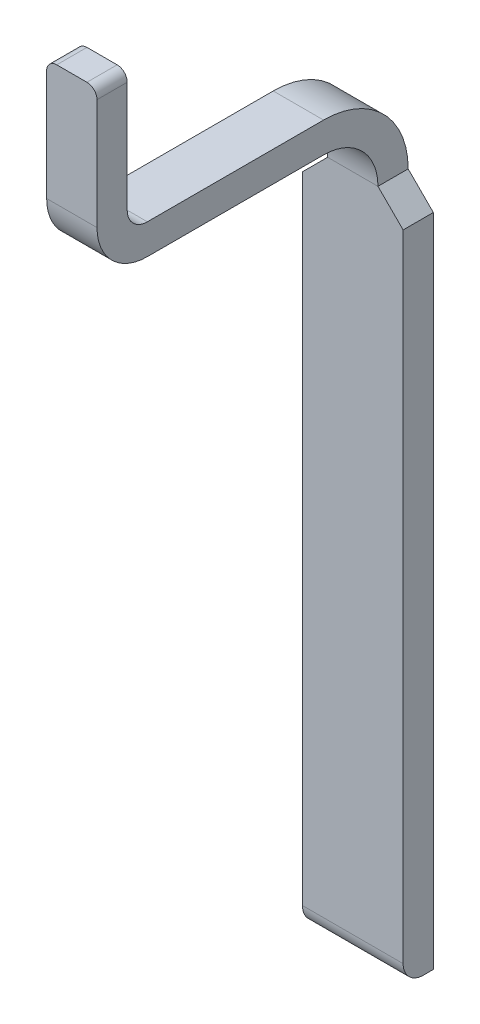
ISO-10303-21;
HEADER;
FILE_DESCRIPTION(('STEP AP214'),'2;1');
FILE_NAME('part.step','',(''),(''),'','','');
FILE_SCHEMA(('AUTOMOTIVE_DESIGN { 1 0 10303 214 1 1 1 1 }'));
ENDSEC;
DATA;
#1=APPLICATION_CONTEXT('core data for automotive mechanical design processes');
#2=APPLICATION_PROTOCOL_DEFINITION('international standard','automotive_design',2000,#1);
#3=PRODUCT_CONTEXT('',#1,'mechanical');
#4=PRODUCT('Part','Part','',(#3));
#5=PRODUCT_RELATED_PRODUCT_CATEGORY('part','',(#4));
#6=PRODUCT_DEFINITION_FORMATION('','',#4);
#7=PRODUCT_DEFINITION_CONTEXT('part definition',#1,'design');
#8=PRODUCT_DEFINITION('design','',#6,#7);
#9=PRODUCT_DEFINITION_SHAPE('','',#8);
#10=(LENGTH_UNIT() NAMED_UNIT(*) SI_UNIT(.MILLI.,.METRE.));
#11=(NAMED_UNIT(*) PLANE_ANGLE_UNIT() SI_UNIT($,.RADIAN.));
#12=(NAMED_UNIT(*) SI_UNIT($,.STERADIAN.) SOLID_ANGLE_UNIT());
#13=UNCERTAINTY_MEASURE_WITH_UNIT(LENGTH_MEASURE(1.E-05),#10,'distance_accuracy_value','');
#14=(GEOMETRIC_REPRESENTATION_CONTEXT(3) GLOBAL_UNCERTAINTY_ASSIGNED_CONTEXT((#13)) GLOBAL_UNIT_ASSIGNED_CONTEXT((#10,
#11,#12)) REPRESENTATION_CONTEXT('',''));
#15=CARTESIAN_POINT('',(0.,0.,0.));
#16=DIRECTION('',(0.,0.,1.));
#17=DIRECTION('',(1.,0.,0.));
#18=AXIS2_PLACEMENT_3D('',#15,#16,#17);
#19=CARTESIAN_POINT('',(-0.4,2.03,-0.12));
#20=DIRECTION('',(0.,0.,-1.));
#21=DIRECTION('',(-1.,0.,0.));
#22=AXIS2_PLACEMENT_3D('',#19,#20,#21);
#23=PLANE('',#22);
#24=DIRECTION('',(0.,-1.,0.));
#25=VECTOR('',#24,1.);
#26=CARTESIAN_POINT('',(-0.9,2.03,-0.12));
#27=LINE('',#26,#25);
#28=CARTESIAN_POINT('',(-0.9,1.905,-0.12));
#29=VERTEX_POINT('',#28);
#30=CARTESIAN_POINT('',(-0.9,-1.25,-0.12));
#31=VERTEX_POINT('',#30);
#32=EDGE_CURVE('E11',#29,#31,#27,.T.);
#33=ORIENTED_EDGE('',*,*,#32,.T.);
#34=DIRECTION('',(1.,0.,0.));
#35=VECTOR('',#34,1.);
#36=CARTESIAN_POINT('',(-0.4,-1.25,-0.12));
#37=LINE('',#36,#35);
#38=CARTESIAN_POINT('',(-0.4,-1.25,-0.12));
#39=VERTEX_POINT('',#38);
#40=EDGE_CURVE('E168',#31,#39,#37,.T.);
#41=ORIENTED_EDGE('',*,*,#40,.T.);
#42=DIRECTION('',(0.,-1.,0.));
#43=VECTOR('',#42,1.);
#44=CARTESIAN_POINT('',(-0.4,2.03,-0.12));
#45=LINE('',#44,#43);
#46=CARTESIAN_POINT('',(-0.4,1.905,-0.12));
#47=VERTEX_POINT('',#46);
#48=EDGE_CURVE('E27',#47,#39,#45,.T.);
#49=ORIENTED_EDGE('',*,*,#48,.F.);
#50=DIRECTION('',(-0.707106781186547,0.707106781186548,0.));
#51=VECTOR('',#50,1.);
#52=CARTESIAN_POINT('',(-0.4,1.905,-0.12));
#53=LINE('',#52,#51);
#54=CARTESIAN_POINT('',(-0.525,2.03,-0.12));
#55=VERTEX_POINT('',#54);
#56=EDGE_CURVE('E20',#47,#55,#53,.T.);
#57=ORIENTED_EDGE('',*,*,#56,.T.);
#58=DIRECTION('',(-1.,0.,0.));
#59=VECTOR('',#58,1.);
#60=CARTESIAN_POINT('',(-0.4,2.03,-0.12));
#61=LINE('',#60,#59);
#62=CARTESIAN_POINT('',(-0.775,2.03,-0.12));
#63=VERTEX_POINT('',#62);
#64=EDGE_CURVE('E117',#55,#63,#61,.T.);
#65=ORIENTED_EDGE('',*,*,#64,.T.);
#66=DIRECTION('',(-0.707106781186547,-0.707106781186548,0.));
#67=VECTOR('',#66,1.);
#68=CARTESIAN_POINT('',(-0.775,2.03,-0.12));
#69=LINE('',#68,#67);
#70=EDGE_CURVE('E120',#63,#29,#69,.T.);
#71=ORIENTED_EDGE('',*,*,#70,.T.);
#72=EDGE_LOOP('',(#33,#41,#49,#57,#65,#71));
#73=FACE_BOUND('',#72,.T.);
#74=ADVANCED_FACE('F16',(#73),#23,.F.);
#75=CARTESIAN_POINT('',(-0.9,-1.35,-0.27));
#76=DIRECTION('',(1.,0.,0.));
#77=DIRECTION('',(0.,-1.,0.));
#78=AXIS2_PLACEMENT_3D('',#75,#76,#77);
#79=PLANE('',#78);
#80=DIRECTION('',(0.,0.,-1.));
#81=VECTOR('',#80,1.);
#82=CARTESIAN_POINT('',(-0.9,-1.35,-0.12));
#83=LINE('',#82,#81);
#84=CARTESIAN_POINT('',(-0.9,-1.35,-0.22));
#85=VERTEX_POINT('',#84);
#86=CARTESIAN_POINT('',(-0.9,-1.35,-0.27));
#87=VERTEX_POINT('',#86);
#88=EDGE_CURVE('E256',#85,#87,#83,.T.);
#89=ORIENTED_EDGE('',*,*,#88,.F.);
#90=CARTESIAN_POINT('',(-0.9,-1.25,-0.22));
#91=DIRECTION('',(-1.,0.,0.));
#92=DIRECTION('',(0.,1.,0.));
#93=AXIS2_PLACEMENT_3D('',#90,#91,#92);
#94=CIRCLE('',#93,0.1);
#95=EDGE_CURVE('E197',#85,#31,#94,.T.);
#96=ORIENTED_EDGE('',*,*,#95,.T.);
#97=ORIENTED_EDGE('',*,*,#32,.F.);
#98=DIRECTION('',(0.,0.,-1.));
#99=VECTOR('',#98,1.);
#100=CARTESIAN_POINT('',(-0.9,1.905,-0.27));
#101=LINE('',#100,#99);
#102=CARTESIAN_POINT('',(-0.9,1.905,-0.27));
#103=VERTEX_POINT('',#102);
#104=EDGE_CURVE('E158',#29,#103,#101,.T.);
#105=ORIENTED_EDGE('',*,*,#104,.T.);
#106=DIRECTION('',(0.,1.,0.));
#107=VECTOR('',#106,1.);
#108=CARTESIAN_POINT('',(-0.9,-1.35,-0.27));
#109=LINE('',#108,#107);
#110=EDGE_CURVE('E293',#87,#103,#109,.T.);
#111=ORIENTED_EDGE('',*,*,#110,.F.);
#112=EDGE_LOOP('',(#89,#96,#97,#105,#111));
#113=FACE_BOUND('',#112,.T.);
#114=ADVANCED_FACE('F426',(#113),#79,.F.);
#115=CARTESIAN_POINT('',(-0.4,-1.35,-0.27));
#116=DIRECTION('',(1.,0.,0.));
#117=DIRECTION('',(0.,-1.,0.));
#118=AXIS2_PLACEMENT_3D('',#115,#116,#117);
#119=PLANE('',#118);
#120=ORIENTED_EDGE('',*,*,#48,.T.);
#121=CARTESIAN_POINT('',(-0.4,-1.25,-0.22));
#122=DIRECTION('',(1.,0.,0.));
#123=DIRECTION('',(0.,1.,0.));
#124=AXIS2_PLACEMENT_3D('',#121,#122,#123);
#125=CIRCLE('',#124,0.1);
#126=CARTESIAN_POINT('',(-0.4,-1.35,-0.22));
#127=VERTEX_POINT('',#126);
#128=EDGE_CURVE('E691',#39,#127,#125,.T.);
#129=ORIENTED_EDGE('',*,*,#128,.T.);
#130=DIRECTION('',(0.,0.,-1.));
#131=VECTOR('',#130,1.);
#132=CARTESIAN_POINT('',(-0.4,-1.35,-0.12));
#133=LINE('',#132,#131);
#134=CARTESIAN_POINT('',(-0.4,-1.35,-0.27));
#135=VERTEX_POINT('',#134);
#136=EDGE_CURVE('E252',#127,#135,#133,.T.);
#137=ORIENTED_EDGE('',*,*,#136,.T.);
#138=DIRECTION('',(0.,1.,0.));
#139=VECTOR('',#138,1.);
#140=CARTESIAN_POINT('',(-0.4,-1.35,-0.27));
#141=LINE('',#140,#139);
#142=CARTESIAN_POINT('',(-0.4,1.905,-0.27));
#143=VERTEX_POINT('',#142);
#144=EDGE_CURVE('E165',#135,#143,#141,.T.);
#145=ORIENTED_EDGE('',*,*,#144,.T.);
#146=DIRECTION('',(0.,0.,1.));
#147=VECTOR('',#146,1.);
#148=CARTESIAN_POINT('',(-0.4,1.905,-0.12));
#149=LINE('',#148,#147);
#150=EDGE_CURVE('E174',#143,#47,#149,.T.);
#151=ORIENTED_EDGE('',*,*,#150,.T.);
#152=EDGE_LOOP('',(#120,#129,#137,#145,#151));
#153=FACE_BOUND('',#152,.T.);
#154=ADVANCED_FACE('F421',(#153),#119,.T.);
#155=CARTESIAN_POINT('',(-0.525,2.03,0.15));
#156=DIRECTION('',(1.,0.,0.));
#157=DIRECTION('',(0.,0.,1.));
#158=AXIS2_PLACEMENT_3D('',#155,#156,#157);
#159=CYLINDRICAL_SURFACE('',#158,0.27);
#160=CARTESIAN_POINT('',(-0.775,2.03,0.15));
#161=DIRECTION('',(1.,0.,0.));
#162=DIRECTION('',(0.,-1.,0.));
#163=AXIS2_PLACEMENT_3D('',#160,#161,#162);
#164=CIRCLE('',#163,0.27);
#165=CARTESIAN_POINT('',(-0.775,2.3,0.15));
#166=VERTEX_POINT('',#165);
#167=EDGE_CURVE('E132',#63,#166,#164,.T.);
#168=ORIENTED_EDGE('',*,*,#167,.F.);
#169=ORIENTED_EDGE('',*,*,#64,.F.);
#170=CARTESIAN_POINT('',(-0.525,2.03,0.15));
#171=DIRECTION('',(1.,0.,0.));
#172=DIRECTION('',(0.,-1.,0.));
#173=AXIS2_PLACEMENT_3D('',#170,#171,#172);
#174=CIRCLE('',#173,0.27);
#175=CARTESIAN_POINT('',(-0.525,2.3,0.15));
#176=VERTEX_POINT('',#175);
#177=EDGE_CURVE('E190',#55,#176,#174,.T.);
#178=ORIENTED_EDGE('',*,*,#177,.T.);
#179=DIRECTION('',(-1.,0.,0.));
#180=VECTOR('',#179,1.);
#181=CARTESIAN_POINT('',(-0.525,2.3,0.15));
#182=LINE('',#181,#180);
#183=EDGE_CURVE('E129',#176,#166,#182,.T.);
#184=ORIENTED_EDGE('',*,*,#183,.T.);
#185=EDGE_LOOP('',(#168,#169,#178,#184));
#186=FACE_BOUND('',#185,.T.);
#187=ADVANCED_FACE('F134',(#186),#159,.F.);
#188=CARTESIAN_POINT('',(-0.525,2.3,0.15));
#189=DIRECTION('',(0.,-1.,0.));
#190=DIRECTION('',(0.,0.,-1.));
#191=AXIS2_PLACEMENT_3D('',#188,#189,#190);
#192=PLANE('',#191);
#193=DIRECTION('',(0.,0.,1.));
#194=VECTOR('',#193,1.);
#195=CARTESIAN_POINT('',(-0.775,2.3,0.15));
#196=LINE('',#195,#194);
#197=CARTESIAN_POINT('',(-0.775,2.3,1.025));
#198=VERTEX_POINT('',#197);
#199=EDGE_CURVE('E139',#166,#198,#196,.T.);
#200=ORIENTED_EDGE('',*,*,#199,.F.);
#201=ORIENTED_EDGE('',*,*,#183,.F.);
#202=DIRECTION('',(0.,0.,1.));
#203=VECTOR('',#202,1.);
#204=CARTESIAN_POINT('',(-0.525,2.3,0.15));
#205=LINE('',#204,#203);
#206=CARTESIAN_POINT('',(-0.525,2.3,1.025));
#207=VERTEX_POINT('',#206);
#208=EDGE_CURVE('E186',#176,#207,#205,.T.);
#209=ORIENTED_EDGE('',*,*,#208,.T.);
#210=DIRECTION('',(-1.,0.,0.));
#211=VECTOR('',#210,1.);
#212=CARTESIAN_POINT('',(-0.525,2.3,1.025));
#213=LINE('',#212,#211);
#214=EDGE_CURVE('E175',#207,#198,#213,.T.);
#215=ORIENTED_EDGE('',*,*,#214,.T.);
#216=EDGE_LOOP('',(#200,#201,#209,#215));
#217=FACE_BOUND('',#216,.T.);
#218=ADVANCED_FACE('F412',(#217),#192,.T.);
#219=CARTESIAN_POINT('',(-0.525,2.55,1.025));
#220=DIRECTION('',(1.,0.,0.));
#221=DIRECTION('',(0.,0.,1.));
#222=AXIS2_PLACEMENT_3D('',#219,#220,#221);
#223=CYLINDRICAL_SURFACE('',#222,0.25);
#224=CARTESIAN_POINT('',(-0.775,2.55,1.025));
#225=DIRECTION('',(-1.,0.,0.));
#226=DIRECTION('',(0.,1.,0.));
#227=AXIS2_PLACEMENT_3D('',#224,#225,#226);
#228=CIRCLE('',#227,0.25);
#229=CARTESIAN_POINT('',(-0.775,2.55,1.275));
#230=VERTEX_POINT('',#229);
#231=EDGE_CURVE('E219',#198,#230,#228,.T.);
#232=ORIENTED_EDGE('',*,*,#231,.F.);
#233=ORIENTED_EDGE('',*,*,#214,.F.);
#234=CARTESIAN_POINT('',(-0.525,2.55,1.025));
#235=DIRECTION('',(-1.,0.,0.));
#236=DIRECTION('',(0.,1.,0.));
#237=AXIS2_PLACEMENT_3D('',#234,#235,#236);
#238=CIRCLE('',#237,0.25);
#239=CARTESIAN_POINT('',(-0.525,2.55,1.275));
#240=VERTEX_POINT('',#239);
#241=EDGE_CURVE('E191',#207,#240,#238,.T.);
#242=ORIENTED_EDGE('',*,*,#241,.T.);
#243=DIRECTION('',(-1.,0.,0.));
#244=VECTOR('',#243,1.);
#245=CARTESIAN_POINT('',(-0.525,2.55,1.275));
#246=LINE('',#245,#244);
#247=EDGE_CURVE('E178',#240,#230,#246,.T.);
#248=ORIENTED_EDGE('',*,*,#247,.T.);
#249=EDGE_LOOP('',(#232,#233,#242,#248));
#250=FACE_BOUND('',#249,.T.);
#251=ADVANCED_FACE('F410',(#250),#223,.T.);
#252=CARTESIAN_POINT('',(-0.525,2.55,1.275));
#253=DIRECTION('',(0.,0.,1.));
#254=DIRECTION('',(0.,-1.,0.));
#255=AXIS2_PLACEMENT_3D('',#252,#253,#254);
#256=PLANE('',#255);
#257=DIRECTION('',(0.,1.,0.));
#258=VECTOR('',#257,1.);
#259=CARTESIAN_POINT('',(-0.525,2.55,1.275));
#260=LINE('',#259,#258);
#261=CARTESIAN_POINT('',(-0.525,3.1,1.275));
#262=VERTEX_POINT('',#261);
#263=EDGE_CURVE('E184',#240,#262,#260,.T.);
#264=ORIENTED_EDGE('',*,*,#263,.T.);
#265=CARTESIAN_POINT('',(-0.575,3.1,1.275));
#266=DIRECTION('',(0.,0.,1.));
#267=DIRECTION('',(0.,-1.,0.));
#268=AXIS2_PLACEMENT_3D('',#265,#266,#267);
#269=CIRCLE('',#268,0.05);
#270=CARTESIAN_POINT('',(-0.575,3.15,1.275));
#271=VERTEX_POINT('',#270);
#272=EDGE_CURVE('E196',#262,#271,#269,.T.);
#273=ORIENTED_EDGE('',*,*,#272,.T.);
#274=DIRECTION('',(-1.,0.,0.));
#275=VECTOR('',#274,1.);
#276=CARTESIAN_POINT('',(-0.525,3.15,1.275));
#277=LINE('',#276,#275);
#278=CARTESIAN_POINT('',(-0.725,3.15,1.275));
#279=VERTEX_POINT('',#278);
#280=EDGE_CURVE('E287',#271,#279,#277,.T.);
#281=ORIENTED_EDGE('',*,*,#280,.T.);
#282=CARTESIAN_POINT('',(-0.725,3.1,1.275));
#283=DIRECTION('',(0.,0.,1.));
#284=DIRECTION('',(0.,-1.,0.));
#285=AXIS2_PLACEMENT_3D('',#282,#283,#284);
#286=CIRCLE('',#285,0.05);
#287=CARTESIAN_POINT('',(-0.775,3.1,1.275));
#288=VERTEX_POINT('',#287);
#289=EDGE_CURVE('E170',#279,#288,#286,.T.);
#290=ORIENTED_EDGE('',*,*,#289,.T.);
#291=DIRECTION('',(0.,1.,0.));
#292=VECTOR('',#291,1.);
#293=CARTESIAN_POINT('',(-0.775,2.55,1.275));
#294=LINE('',#293,#292);
#295=EDGE_CURVE('E225',#230,#288,#294,.T.);
#296=ORIENTED_EDGE('',*,*,#295,.F.);
#297=ORIENTED_EDGE('',*,*,#247,.F.);
#298=EDGE_LOOP('',(#264,#273,#281,#290,#296,#297));
#299=FACE_BOUND('',#298,.T.);
#300=ADVANCED_FACE('F18',(#299),#256,.T.);
#301=CARTESIAN_POINT('',(-0.525,3.15,1.275));
#302=DIRECTION('',(0.,1.,0.));
#303=DIRECTION('',(1.,0.,0.));
#304=AXIS2_PLACEMENT_3D('',#301,#302,#303);
#305=PLANE('',#304);
#306=ORIENTED_EDGE('',*,*,#280,.F.);
#307=DIRECTION('',(0.,0.,-1.));
#308=VECTOR('',#307,1.);
#309=CARTESIAN_POINT('',(-0.575,3.15,1.275));
#310=LINE('',#309,#308);
#311=CARTESIAN_POINT('',(-0.575,3.15,1.125));
#312=VERTEX_POINT('',#311);
#313=EDGE_CURVE('E205',#271,#312,#310,.T.);
#314=ORIENTED_EDGE('',*,*,#313,.T.);
#315=DIRECTION('',(-1.,0.,0.));
#316=VECTOR('',#315,1.);
#317=CARTESIAN_POINT('',(-0.525,3.15,1.125));
#318=LINE('',#317,#316);
#319=CARTESIAN_POINT('',(-0.725,3.15,1.125));
#320=VERTEX_POINT('',#319);
#321=EDGE_CURVE('E274',#312,#320,#318,.T.);
#322=ORIENTED_EDGE('',*,*,#321,.T.);
#323=DIRECTION('',(0.,0.,1.));
#324=VECTOR('',#323,1.);
#325=CARTESIAN_POINT('',(-0.725,3.15,1.275));
#326=LINE('',#325,#324);
#327=EDGE_CURVE('E173',#320,#279,#326,.T.);
#328=ORIENTED_EDGE('',*,*,#327,.T.);
#329=EDGE_LOOP('',(#306,#314,#322,#328));
#330=FACE_BOUND('',#329,.T.);
#331=ADVANCED_FACE('F395',(#330),#305,.T.);
#332=CARTESIAN_POINT('',(-0.525,2.55,1.125));
#333=DIRECTION('',(0.,0.,-1.));
#334=DIRECTION('',(0.,-1.,0.));
#335=AXIS2_PLACEMENT_3D('',#332,#333,#334);
#336=PLANE('',#335);
#337=ORIENTED_EDGE('',*,*,#321,.F.);
#338=CARTESIAN_POINT('',(-0.575,3.1,1.125));
#339=DIRECTION('',(0.,0.,-1.));
#340=DIRECTION('',(0.,1.,0.));
#341=AXIS2_PLACEMENT_3D('',#338,#339,#340);
#342=CIRCLE('',#341,0.05);
#343=CARTESIAN_POINT('',(-0.525,3.1,1.125));
#344=VERTEX_POINT('',#343);
#345=EDGE_CURVE('E201',#312,#344,#342,.T.);
#346=ORIENTED_EDGE('',*,*,#345,.T.);
#347=DIRECTION('',(0.,-1.,0.));
#348=VECTOR('',#347,1.);
#349=CARTESIAN_POINT('',(-0.525,2.55,1.125));
#350=LINE('',#349,#348);
#351=CARTESIAN_POINT('',(-0.525,2.55,1.125));
#352=VERTEX_POINT('',#351);
#353=EDGE_CURVE('E180',#344,#352,#350,.T.);
#354=ORIENTED_EDGE('',*,*,#353,.T.);
#355=DIRECTION('',(-1.,0.,0.));
#356=VECTOR('',#355,1.);
#357=CARTESIAN_POINT('',(-0.525,2.55,1.125));
#358=LINE('',#357,#356);
#359=CARTESIAN_POINT('',(-0.775,2.55,1.125));
#360=VERTEX_POINT('',#359);
#361=EDGE_CURVE('E245',#352,#360,#358,.T.);
#362=ORIENTED_EDGE('',*,*,#361,.T.);
#363=DIRECTION('',(0.,-1.,0.));
#364=VECTOR('',#363,1.);
#365=CARTESIAN_POINT('',(-0.775,2.55,1.125));
#366=LINE('',#365,#364);
#367=CARTESIAN_POINT('',(-0.775,3.1,1.125));
#368=VERTEX_POINT('',#367);
#369=EDGE_CURVE('E232',#368,#360,#366,.T.);
#370=ORIENTED_EDGE('',*,*,#369,.F.);
#371=CARTESIAN_POINT('',(-0.725,3.1,1.125));
#372=DIRECTION('',(0.,0.,-1.));
#373=DIRECTION('',(0.,1.,0.));
#374=AXIS2_PLACEMENT_3D('',#371,#372,#373);
#375=CIRCLE('',#374,0.05);
#376=EDGE_CURVE('E207',#368,#320,#375,.T.);
#377=ORIENTED_EDGE('',*,*,#376,.T.);
#378=EDGE_LOOP('',(#337,#346,#354,#362,#370,#377));
#379=FACE_BOUND('',#378,.T.);
#380=ADVANCED_FACE('F398',(#379),#336,.T.);
#381=CARTESIAN_POINT('',(-0.525,2.55,1.025));
#382=DIRECTION('',(1.,0.,0.));
#383=DIRECTION('',(0.,0.,1.));
#384=AXIS2_PLACEMENT_3D('',#381,#382,#383);
#385=CYLINDRICAL_SURFACE('',#384,0.1);
#386=CARTESIAN_POINT('',(-0.775,2.55,1.025));
#387=DIRECTION('',(1.,0.,0.));
#388=DIRECTION('',(0.,1.,0.));
#389=AXIS2_PLACEMENT_3D('',#386,#387,#388);
#390=CIRCLE('',#389,0.1);
#391=CARTESIAN_POINT('',(-0.775,2.45,1.025));
#392=VERTEX_POINT('',#391);
#393=EDGE_CURVE('E227',#360,#392,#390,.T.);
#394=ORIENTED_EDGE('',*,*,#393,.F.);
#395=ORIENTED_EDGE('',*,*,#361,.F.);
#396=CARTESIAN_POINT('',(-0.525,2.55,1.025));
#397=DIRECTION('',(1.,0.,0.));
#398=DIRECTION('',(0.,1.,0.));
#399=AXIS2_PLACEMENT_3D('',#396,#397,#398);
#400=CIRCLE('',#399,0.1);
#401=CARTESIAN_POINT('',(-0.525,2.45,1.025));
#402=VERTEX_POINT('',#401);
#403=EDGE_CURVE('E246',#352,#402,#400,.T.);
#404=ORIENTED_EDGE('',*,*,#403,.T.);
#405=DIRECTION('',(-1.,0.,0.));
#406=VECTOR('',#405,1.);
#407=CARTESIAN_POINT('',(-0.525,2.45,1.025));
#408=LINE('',#407,#406);
#409=EDGE_CURVE('E41',#402,#392,#408,.T.);
#410=ORIENTED_EDGE('',*,*,#409,.T.);
#411=EDGE_LOOP('',(#394,#395,#404,#410));
#412=FACE_BOUND('',#411,.T.);
#413=ADVANCED_FACE('F401',(#412),#385,.F.);
#414=CARTESIAN_POINT('',(-0.525,2.45,0.15));
#415=DIRECTION('',(0.,1.,0.));
#416=DIRECTION('',(1.,0.,0.));
#417=AXIS2_PLACEMENT_3D('',#414,#415,#416);
#418=PLANE('',#417);
#419=DIRECTION('',(0.,0.,-1.));
#420=VECTOR('',#419,1.);
#421=CARTESIAN_POINT('',(-0.775,2.45,0.15));
#422=LINE('',#421,#420);
#423=CARTESIAN_POINT('',(-0.775,2.45,0.15));
#424=VERTEX_POINT('',#423);
#425=EDGE_CURVE('E231',#392,#424,#422,.T.);
#426=ORIENTED_EDGE('',*,*,#425,.F.);
#427=ORIENTED_EDGE('',*,*,#409,.F.);
#428=DIRECTION('',(0.,0.,-1.));
#429=VECTOR('',#428,1.);
#430=CARTESIAN_POINT('',(-0.525,2.45,0.15));
#431=LINE('',#430,#429);
#432=CARTESIAN_POINT('',(-0.525,2.45,0.15));
#433=VERTEX_POINT('',#432);
#434=EDGE_CURVE('E247',#402,#433,#431,.T.);
#435=ORIENTED_EDGE('',*,*,#434,.T.);
#436=DIRECTION('',(-1.,0.,0.));
#437=VECTOR('',#436,1.);
#438=CARTESIAN_POINT('',(-0.525,2.45,0.15));
#439=LINE('',#438,#437);
#440=EDGE_CURVE('E242',#433,#424,#439,.T.);
#441=ORIENTED_EDGE('',*,*,#440,.T.);
#442=EDGE_LOOP('',(#426,#427,#435,#441));
#443=FACE_BOUND('',#442,.T.);
#444=ADVANCED_FACE('F403',(#443),#418,.T.);
#445=CARTESIAN_POINT('',(-0.525,2.03,0.15));
#446=DIRECTION('',(1.,0.,0.));
#447=DIRECTION('',(0.,-1.,0.));
#448=AXIS2_PLACEMENT_3D('',#445,#446,#447);
#449=PLANE('',#448);
#450=ORIENTED_EDGE('',*,*,#353,.F.);
#451=DIRECTION('',(0.,0.,1.));
#452=VECTOR('',#451,1.);
#453=CARTESIAN_POINT('',(-0.525,3.1,0.15));
#454=LINE('',#453,#452);
#455=EDGE_CURVE('E206',#344,#262,#454,.T.);
#456=ORIENTED_EDGE('',*,*,#455,.T.);
#457=ORIENTED_EDGE('',*,*,#263,.F.);
#458=ORIENTED_EDGE('',*,*,#241,.F.);
#459=ORIENTED_EDGE('',*,*,#208,.F.);
#460=ORIENTED_EDGE('',*,*,#177,.F.);
#461=DIRECTION('',(0.,0.,-1.));
#462=VECTOR('',#461,1.);
#463=CARTESIAN_POINT('',(-0.525,2.03,-0.27));
#464=LINE('',#463,#462);
#465=CARTESIAN_POINT('',(-0.525,2.03,-0.27));
#466=VERTEX_POINT('',#465);
#467=EDGE_CURVE('E154',#55,#466,#464,.T.);
#468=ORIENTED_EDGE('',*,*,#467,.T.);
#469=CARTESIAN_POINT('',(-0.525,2.03,0.15));
#470=DIRECTION('',(-1.,0.,0.));
#471=DIRECTION('',(0.,-1.,0.));
#472=AXIS2_PLACEMENT_3D('',#469,#470,#471);
#473=CIRCLE('',#472,0.42);
#474=EDGE_CURVE('E185',#433,#466,#473,.T.);
#475=ORIENTED_EDGE('',*,*,#474,.F.);
#476=ORIENTED_EDGE('',*,*,#434,.F.);
#477=ORIENTED_EDGE('',*,*,#403,.F.);
#478=EDGE_LOOP('',(#450,#456,#457,#458,#459,#460,#468,#475,#476,#477));
#479=FACE_BOUND('',#478,.T.);
#480=ADVANCED_FACE('F333',(#479),#449,.T.);
#481=CARTESIAN_POINT('',(-0.525,2.03,0.15));
#482=DIRECTION('',(1.,0.,0.));
#483=DIRECTION('',(0.,0.,1.));
#484=AXIS2_PLACEMENT_3D('',#481,#482,#483);
#485=CYLINDRICAL_SURFACE('',#484,0.42);
#486=CARTESIAN_POINT('',(-0.775,2.03,0.15));
#487=DIRECTION('',(-1.,0.,0.));
#488=DIRECTION('',(0.,-1.,0.));
#489=AXIS2_PLACEMENT_3D('',#486,#487,#488);
#490=CIRCLE('',#489,0.42);
#491=CARTESIAN_POINT('',(-0.775,2.03,-0.27));
#492=VERTEX_POINT('',#491);
#493=EDGE_CURVE('E140',#424,#492,#490,.T.);
#494=ORIENTED_EDGE('',*,*,#493,.F.);
#495=ORIENTED_EDGE('',*,*,#440,.F.);
#496=ORIENTED_EDGE('',*,*,#474,.T.);
#497=DIRECTION('',(-1.,0.,0.));
#498=VECTOR('',#497,1.);
#499=CARTESIAN_POINT('',(-0.4,2.03,-0.27));
#500=LINE('',#499,#498);
#501=EDGE_CURVE('E278',#466,#492,#500,.T.);
#502=ORIENTED_EDGE('',*,*,#501,.T.);
#503=EDGE_LOOP('',(#494,#495,#496,#502));
#504=FACE_BOUND('',#503,.T.);
#505=ADVANCED_FACE('F325',(#504),#485,.T.);
#506=CARTESIAN_POINT('',(-0.775,2.03,0.15));
#507=DIRECTION('',(1.,0.,0.));
#508=DIRECTION('',(0.,-1.,0.));
#509=AXIS2_PLACEMENT_3D('',#506,#507,#508);
#510=PLANE('',#509);
#511=ORIENTED_EDGE('',*,*,#295,.T.);
#512=DIRECTION('',(0.,0.,-1.));
#513=VECTOR('',#512,1.);
#514=CARTESIAN_POINT('',(-0.775,3.1,1.125));
#515=LINE('',#514,#513);
#516=EDGE_CURVE('E211',#288,#368,#515,.T.);
#517=ORIENTED_EDGE('',*,*,#516,.T.);
#518=ORIENTED_EDGE('',*,*,#369,.T.);
#519=ORIENTED_EDGE('',*,*,#393,.T.);
#520=ORIENTED_EDGE('',*,*,#425,.T.);
#521=ORIENTED_EDGE('',*,*,#493,.T.);
#522=DIRECTION('',(0.,0.,1.));
#523=VECTOR('',#522,1.);
#524=CARTESIAN_POINT('',(-0.775,2.03,-0.27));
#525=LINE('',#524,#523);
#526=EDGE_CURVE('E144',#492,#63,#525,.T.);
#527=ORIENTED_EDGE('',*,*,#526,.T.);
#528=ORIENTED_EDGE('',*,*,#167,.T.);
#529=ORIENTED_EDGE('',*,*,#199,.T.);
#530=ORIENTED_EDGE('',*,*,#231,.T.);
#531=EDGE_LOOP('',(#511,#517,#518,#519,#520,#521,#527,#528,#529,#530));
#532=FACE_BOUND('',#531,.T.);
#533=ADVANCED_FACE('F146',(#532),#510,.F.);
#534=CARTESIAN_POINT('',(-0.725,3.1,0.15));
#535=DIRECTION('',(0.,0.,-1.));
#536=DIRECTION('',(1.,0.,0.));
#537=AXIS2_PLACEMENT_3D('',#534,#535,#536);
#538=CYLINDRICAL_SURFACE('',#537,0.05);
#539=ORIENTED_EDGE('',*,*,#289,.F.);
#540=ORIENTED_EDGE('',*,*,#327,.F.);
#541=ORIENTED_EDGE('',*,*,#376,.F.);
#542=ORIENTED_EDGE('',*,*,#516,.F.);
#543=EDGE_LOOP('',(#539,#540,#541,#542));
#544=FACE_BOUND('',#543,.T.);
#545=ADVANCED_FACE('F389',(#544),#538,.T.);
#546=CARTESIAN_POINT('',(-0.4,1.905,-0.27));
#547=DIRECTION('',(0.707106781186548,0.707106781186547,0.));
#548=DIRECTION('',(0.,0.,-1.));
#549=AXIS2_PLACEMENT_3D('',#546,#547,#548);
#550=PLANE('',#549);
#551=DIRECTION('',(0.707106781186547,-0.707106781186548,0.));
#552=VECTOR('',#551,1.);
#553=CARTESIAN_POINT('',(-0.4,1.905,-0.27));
#554=LINE('',#553,#552);
#555=EDGE_CURVE('E281',#466,#143,#554,.T.);
#556=ORIENTED_EDGE('',*,*,#555,.F.);
#557=ORIENTED_EDGE('',*,*,#467,.F.);
#558=ORIENTED_EDGE('',*,*,#56,.F.);
#559=ORIENTED_EDGE('',*,*,#150,.F.);
#560=EDGE_LOOP('',(#556,#557,#558,#559));
#561=FACE_BOUND('',#560,.T.);
#562=ADVANCED_FACE('F336',(#561),#550,.T.);
#563=CARTESIAN_POINT('',(-0.775,2.03,-0.27));
#564=DIRECTION('',(0.707106781186548,-0.707106781186547,0.));
#565=DIRECTION('',(0.,0.,-1.));
#566=AXIS2_PLACEMENT_3D('',#563,#564,#565);
#567=PLANE('',#566);
#568=DIRECTION('',(0.707106781186547,0.707106781186548,0.));
#569=VECTOR('',#568,1.);
#570=CARTESIAN_POINT('',(-0.775,2.03,-0.27));
#571=LINE('',#570,#569);
#572=EDGE_CURVE('E282',#103,#492,#571,.T.);
#573=ORIENTED_EDGE('',*,*,#572,.F.);
#574=ORIENTED_EDGE('',*,*,#104,.F.);
#575=ORIENTED_EDGE('',*,*,#70,.F.);
#576=ORIENTED_EDGE('',*,*,#526,.F.);
#577=EDGE_LOOP('',(#573,#574,#575,#576));
#578=FACE_BOUND('',#577,.T.);
#579=ADVANCED_FACE('F156',(#578),#567,.F.);
#580=CARTESIAN_POINT('',(-0.4,-1.35,-0.27));
#581=DIRECTION('',(0.,0.,1.));
#582=DIRECTION('',(0.,-1.,0.));
#583=AXIS2_PLACEMENT_3D('',#580,#581,#582);
#584=PLANE('',#583);
#585=ORIENTED_EDGE('',*,*,#110,.T.);
#586=ORIENTED_EDGE('',*,*,#572,.T.);
#587=ORIENTED_EDGE('',*,*,#501,.F.);
#588=ORIENTED_EDGE('',*,*,#555,.T.);
#589=ORIENTED_EDGE('',*,*,#144,.F.);
#590=DIRECTION('',(-1.,0.,0.));
#591=VECTOR('',#590,1.);
#592=CARTESIAN_POINT('',(-0.4,-1.35,-0.27));
#593=LINE('',#592,#591);
#594=EDGE_CURVE('E260',#135,#87,#593,.T.);
#595=ORIENTED_EDGE('',*,*,#594,.T.);
#596=EDGE_LOOP('',(#585,#586,#587,#588,#589,#595));
#597=FACE_BOUND('',#596,.T.);
#598=ADVANCED_FACE('F338',(#597),#584,.F.);
#599=CARTESIAN_POINT('',(-0.4,-1.35,-0.12));
#600=DIRECTION('',(0.,1.,0.));
#601=DIRECTION('',(1.,0.,0.));
#602=AXIS2_PLACEMENT_3D('',#599,#600,#601);
#603=PLANE('',#602);
#604=ORIENTED_EDGE('',*,*,#136,.F.);
#605=DIRECTION('',(-1.,0.,0.));
#606=VECTOR('',#605,1.);
#607=CARTESIAN_POINT('',(-0.4,-1.35,-0.22));
#608=LINE('',#607,#606);
#609=EDGE_CURVE('E192',#127,#85,#608,.T.);
#610=ORIENTED_EDGE('',*,*,#609,.T.);
#611=ORIENTED_EDGE('',*,*,#88,.T.);
#612=ORIENTED_EDGE('',*,*,#594,.F.);
#613=EDGE_LOOP('',(#604,#610,#611,#612));
#614=FACE_BOUND('',#613,.T.);
#615=ADVANCED_FACE('F436',(#614),#603,.F.);
#616=CARTESIAN_POINT('',(-0.575,3.1,1.275));
#617=DIRECTION('',(0.,0.,1.));
#618=DIRECTION('',(-1.,0.,0.));
#619=AXIS2_PLACEMENT_3D('',#616,#617,#618);
#620=CYLINDRICAL_SURFACE('',#619,0.05);
#621=ORIENTED_EDGE('',*,*,#272,.F.);
#622=ORIENTED_EDGE('',*,*,#455,.F.);
#623=ORIENTED_EDGE('',*,*,#345,.F.);
#624=ORIENTED_EDGE('',*,*,#313,.F.);
#625=EDGE_LOOP('',(#621,#622,#623,#624));
#626=FACE_BOUND('',#625,.T.);
#627=ADVANCED_FACE('F406',(#626),#620,.T.);
#628=CARTESIAN_POINT('',(-0.4,-1.25,-0.22));
#629=DIRECTION('',(1.,0.,0.));
#630=DIRECTION('',(0.,0.,1.));
#631=AXIS2_PLACEMENT_3D('',#628,#629,#630);
#632=CYLINDRICAL_SURFACE('',#631,0.1);
#633=ORIENTED_EDGE('',*,*,#128,.F.);
#634=ORIENTED_EDGE('',*,*,#40,.F.);
#635=ORIENTED_EDGE('',*,*,#95,.F.);
#636=ORIENTED_EDGE('',*,*,#609,.F.);
#637=EDGE_LOOP('',(#633,#634,#635,#636));
#638=FACE_BOUND('',#637,.T.);
#639=ADVANCED_FACE('F479',(#638),#632,.T.);
#640=CLOSED_SHELL('',(#74,#114,#154,#187,#218,#251,#300,#331,#380,#413,#444,#480,#505,#533,#545,
#562,#579,#598,#615,#627,#639));
#641=MANIFOLD_SOLID_BREP('B1',#640);
#642=ADVANCED_BREP_SHAPE_REPRESENTATION('',(#18,#641),#14);
#643=SHAPE_DEFINITION_REPRESENTATION(#9,#642);
ENDSEC;
END-ISO-10303-21;
